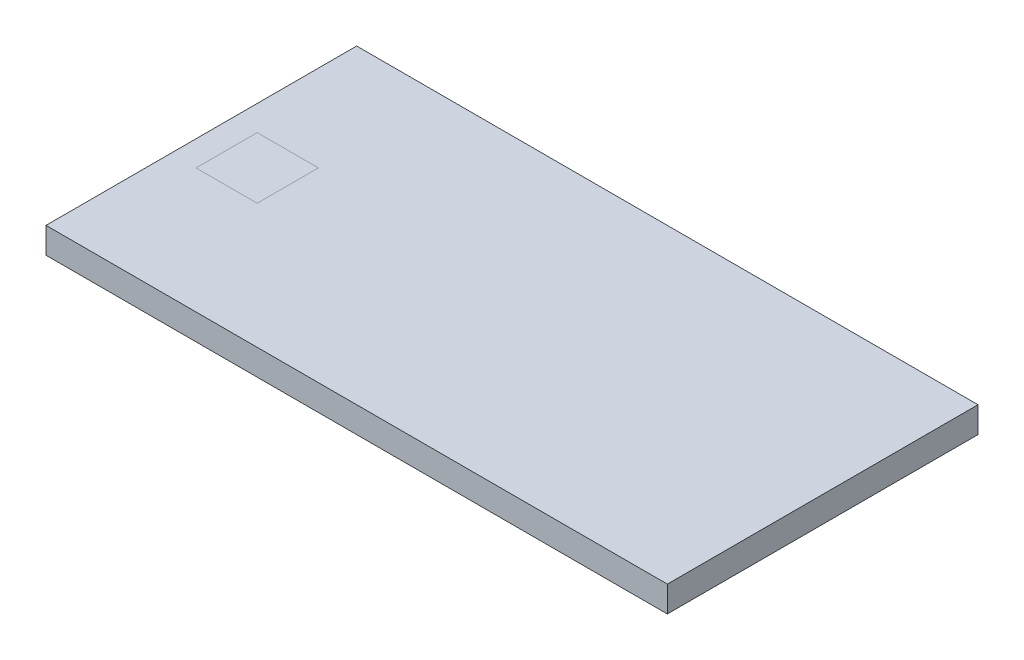
ISO-10303-21;
HEADER;
FILE_DESCRIPTION(('STEP AP214'),'2;1');
FILE_NAME('part.step','',(''),(''),'','','');
FILE_SCHEMA(('AUTOMOTIVE_DESIGN { 1 0 10303 214 1 1 1 1 }'));
ENDSEC;
DATA;
#1=APPLICATION_CONTEXT('core data for automotive mechanical design processes');
#2=APPLICATION_PROTOCOL_DEFINITION('international standard','automotive_design',2000,#1);
#3=PRODUCT_CONTEXT('',#1,'mechanical');
#4=PRODUCT('Part','Part','',(#3));
#5=PRODUCT_RELATED_PRODUCT_CATEGORY('part','',(#4));
#6=PRODUCT_DEFINITION_FORMATION('','',#4);
#7=PRODUCT_DEFINITION_CONTEXT('part definition',#1,'design');
#8=PRODUCT_DEFINITION('design','',#6,#7);
#9=PRODUCT_DEFINITION_SHAPE('','',#8);
#10=(LENGTH_UNIT() NAMED_UNIT(*) SI_UNIT(.MILLI.,.METRE.));
#11=(NAMED_UNIT(*) PLANE_ANGLE_UNIT() SI_UNIT($,.RADIAN.));
#12=(NAMED_UNIT(*) SI_UNIT($,.STERADIAN.) SOLID_ANGLE_UNIT());
#13=UNCERTAINTY_MEASURE_WITH_UNIT(LENGTH_MEASURE(1.E-05),#10,'distance_accuracy_value','');
#14=(GEOMETRIC_REPRESENTATION_CONTEXT(3) GLOBAL_UNCERTAINTY_ASSIGNED_CONTEXT((#13)) GLOBAL_UNIT_ASSIGNED_CONTEXT((#10,
#11,#12)) REPRESENTATION_CONTEXT('',''));
#15=CARTESIAN_POINT('',(0.,0.,0.));
#16=DIRECTION('',(0.,0.,1.));
#17=DIRECTION('',(1.,0.,0.));
#18=AXIS2_PLACEMENT_3D('',#15,#16,#17);
#19=CARTESIAN_POINT('',(914.4,0.,457.2));
#20=DIRECTION('',(0.,-1.,0.));
#21=DIRECTION('',(0.,0.,-1.));
#22=AXIS2_PLACEMENT_3D('',#19,#20,#21);
#23=PLANE('',#22);
#24=DIRECTION('',(-1.,0.,0.));
#25=VECTOR('',#24,1.);
#26=CARTESIAN_POINT('',(914.4,0.,-457.2));
#27=LINE('',#26,#25);
#28=CARTESIAN_POINT('',(914.4,0.,-457.2));
#29=VERTEX_POINT('',#28);
#30=CARTESIAN_POINT('',(-914.4,0.,-457.2));
#31=VERTEX_POINT('',#30);
#32=EDGE_CURVE('E185',#29,#31,#27,.T.);
#33=ORIENTED_EDGE('',*,*,#32,.T.);
#34=DIRECTION('',(0.,0.,1.));
#35=VECTOR('',#34,1.);
#36=CARTESIAN_POINT('',(-914.4,0.,457.2));
#37=LINE('',#36,#35);
#38=CARTESIAN_POINT('',(-914.4,0.,457.2));
#39=VERTEX_POINT('',#38);
#40=EDGE_CURVE('E307',#31,#39,#37,.T.);
#41=ORIENTED_EDGE('',*,*,#40,.T.);
#42=DIRECTION('',(-1.,0.,0.));
#43=VECTOR('',#42,1.);
#44=CARTESIAN_POINT('',(914.4,0.,457.2));
#45=LINE('',#44,#43);
#46=CARTESIAN_POINT('',(914.4,0.,457.2));
#47=VERTEX_POINT('',#46);
#48=EDGE_CURVE('E178',#47,#39,#45,.T.);
#49=ORIENTED_EDGE('',*,*,#48,.F.);
#50=DIRECTION('',(0.,0.,1.));
#51=VECTOR('',#50,1.);
#52=CARTESIAN_POINT('',(914.4,0.,457.2));
#53=LINE('',#52,#51);
#54=EDGE_CURVE('E301',#29,#47,#53,.T.);
#55=ORIENTED_EDGE('',*,*,#54,.F.);
#56=EDGE_LOOP('',(#33,#41,#49,#55));
#57=FACE_BOUND('',#56,.T.);
#58=DIRECTION('',(0.,0.,-1.));
#59=VECTOR('',#58,1.);
#60=CARTESIAN_POINT('',(-660.,0.,457.2));
#61=LINE('',#60,#59);
#62=CARTESIAN_POINT('',(-660.,0.,90.));
#63=VERTEX_POINT('',#62);
#64=CARTESIAN_POINT('',(-660.,0.,-89.9999999999999));
#65=VERTEX_POINT('',#64);
#66=EDGE_CURVE('E12',#63,#65,#61,.T.);
#67=ORIENTED_EDGE('',*,*,#66,.F.);
#68=DIRECTION('',(1.,0.,0.));
#69=VECTOR('',#68,1.);
#70=CARTESIAN_POINT('',(914.4,0.,90.));
#71=LINE('',#70,#69);
#72=CARTESIAN_POINT('',(-840.,0.,90.));
#73=VERTEX_POINT('',#72);
#74=EDGE_CURVE('E202',#73,#63,#71,.T.);
#75=ORIENTED_EDGE('',*,*,#74,.F.);
#76=DIRECTION('',(0.,0.,1.));
#77=VECTOR('',#76,1.);
#78=CARTESIAN_POINT('',(-840.,0.,457.2));
#79=LINE('',#78,#77);
#80=CARTESIAN_POINT('',(-840.,0.,-90.0000000000002));
#81=VERTEX_POINT('',#80);
#82=EDGE_CURVE('E206',#81,#73,#79,.T.);
#83=ORIENTED_EDGE('',*,*,#82,.F.);
#84=DIRECTION('',(-1.,0.,0.));
#85=VECTOR('',#84,1.);
#86=CARTESIAN_POINT('',(914.4,0.,-89.9999999999999));
#87=LINE('',#86,#85);
#88=EDGE_CURVE('E64',#65,#81,#87,.T.);
#89=ORIENTED_EDGE('',*,*,#88,.F.);
#90=EDGE_LOOP('',(#67,#75,#83,#89));
#91=FACE_BOUND('',#90,.T.);
#92=ADVANCED_FACE('F54',(#57,#91),#23,.F.);
#93=CARTESIAN_POINT('',(914.4,-6.35,450.85));
#94=DIRECTION('',(0.,0.,1.));
#95=DIRECTION('',(1.,0.,0.));
#96=AXIS2_PLACEMENT_3D('',#93,#94,#95);
#97=PLANE('',#96);
#98=DIRECTION('',(0.,1.,0.));
#99=VECTOR('',#98,1.);
#100=CARTESIAN_POINT('',(908.05,-6.35,450.85));
#101=LINE('',#100,#99);
#102=CARTESIAN_POINT('',(908.05,-69.85,450.85));
#103=VERTEX_POINT('',#102);
#104=CARTESIAN_POINT('',(908.05,-6.35,450.85));
#105=VERTEX_POINT('',#104);
#106=EDGE_CURVE('E268',#103,#105,#101,.T.);
#107=ORIENTED_EDGE('',*,*,#106,.F.);
#108=DIRECTION('',(-1.,0.,0.));
#109=VECTOR('',#108,1.);
#110=CARTESIAN_POINT('',(914.4,-69.8500000000001,450.85));
#111=LINE('',#110,#109);
#112=CARTESIAN_POINT('',(-908.05,-69.8500000000001,450.85));
#113=VERTEX_POINT('',#112);
#114=EDGE_CURVE('E180',#103,#113,#111,.T.);
#115=ORIENTED_EDGE('',*,*,#114,.T.);
#116=DIRECTION('',(0.,-1.,0.));
#117=VECTOR('',#116,1.);
#118=CARTESIAN_POINT('',(-908.05,-6.35,450.85));
#119=LINE('',#118,#117);
#120=CARTESIAN_POINT('',(-908.05,-6.35,450.85));
#121=VERTEX_POINT('',#120);
#122=EDGE_CURVE('E274',#121,#113,#119,.T.);
#123=ORIENTED_EDGE('',*,*,#122,.F.);
#124=DIRECTION('',(-1.,0.,0.));
#125=VECTOR('',#124,1.);
#126=CARTESIAN_POINT('',(914.4,-6.35,450.85));
#127=LINE('',#126,#125);
#128=EDGE_CURVE('E197',#105,#121,#127,.T.);
#129=ORIENTED_EDGE('',*,*,#128,.F.);
#130=EDGE_LOOP('',(#107,#115,#123,#129));
#131=FACE_BOUND('',#130,.T.);
#132=ADVANCED_FACE('F56',(#131),#97,.F.);
#133=CARTESIAN_POINT('',(914.4,-6.35,450.85));
#134=DIRECTION('',(0.,1.,0.));
#135=DIRECTION('',(0.,0.,1.));
#136=AXIS2_PLACEMENT_3D('',#133,#134,#135);
#137=PLANE('',#136);
#138=DIRECTION('',(0.,0.,-1.));
#139=VECTOR('',#138,1.);
#140=CARTESIAN_POINT('',(908.05,-6.35,450.85));
#141=LINE('',#140,#139);
#142=CARTESIAN_POINT('',(908.05,-6.35,-450.85));
#143=VERTEX_POINT('',#142);
#144=EDGE_CURVE('E261',#105,#143,#141,.T.);
#145=ORIENTED_EDGE('',*,*,#144,.F.);
#146=ORIENTED_EDGE('',*,*,#128,.T.);
#147=DIRECTION('',(0.,0.,1.));
#148=VECTOR('',#147,1.);
#149=CARTESIAN_POINT('',(-908.05,-6.35,450.85));
#150=LINE('',#149,#148);
#151=CARTESIAN_POINT('',(-908.05,-6.35,-450.85));
#152=VERTEX_POINT('',#151);
#153=EDGE_CURVE('E279',#152,#121,#150,.T.);
#154=ORIENTED_EDGE('',*,*,#153,.F.);
#155=DIRECTION('',(-1.,0.,0.));
#156=VECTOR('',#155,1.);
#157=CARTESIAN_POINT('',(914.4,-6.35,-450.85));
#158=LINE('',#157,#156);
#159=EDGE_CURVE('E195',#143,#152,#158,.T.);
#160=ORIENTED_EDGE('',*,*,#159,.F.);
#161=EDGE_LOOP('',(#145,#146,#154,#160));
#162=FACE_BOUND('',#161,.T.);
#163=ADVANCED_FACE('F228',(#162),#137,.F.);
#164=CARTESIAN_POINT('',(914.4,-6.35,-450.85));
#165=DIRECTION('',(0.,0.,-1.));
#166=DIRECTION('',(-1.,0.,0.));
#167=AXIS2_PLACEMENT_3D('',#164,#165,#166);
#168=PLANE('',#167);
#169=DIRECTION('',(0.,-1.,0.));
#170=VECTOR('',#169,1.);
#171=CARTESIAN_POINT('',(908.05,-6.35,-450.85));
#172=LINE('',#171,#170);
#173=CARTESIAN_POINT('',(908.05,-69.85,-450.85));
#174=VERTEX_POINT('',#173);
#175=EDGE_CURVE('E269',#143,#174,#172,.T.);
#176=ORIENTED_EDGE('',*,*,#175,.F.);
#177=ORIENTED_EDGE('',*,*,#159,.T.);
#178=DIRECTION('',(0.,1.,0.));
#179=VECTOR('',#178,1.);
#180=CARTESIAN_POINT('',(-908.05,-6.35,-450.85));
#181=LINE('',#180,#179);
#182=CARTESIAN_POINT('',(-908.05,-69.85,-450.85));
#183=VERTEX_POINT('',#182);
#184=EDGE_CURVE('E284',#183,#152,#181,.T.);
#185=ORIENTED_EDGE('',*,*,#184,.F.);
#186=DIRECTION('',(-1.,0.,0.));
#187=VECTOR('',#186,1.);
#188=CARTESIAN_POINT('',(914.4,-69.85,-450.85));
#189=LINE('',#188,#187);
#190=EDGE_CURVE('E193',#174,#183,#189,.T.);
#191=ORIENTED_EDGE('',*,*,#190,.F.);
#192=EDGE_LOOP('',(#176,#177,#185,#191));
#193=FACE_BOUND('',#192,.T.);
#194=ADVANCED_FACE('F251',(#193),#168,.F.);
#195=CARTESIAN_POINT('',(914.4,-69.85,-381.));
#196=DIRECTION('',(0.,0.,-1.));
#197=DIRECTION('',(-1.,0.,0.));
#198=AXIS2_PLACEMENT_3D('',#195,#196,#197);
#199=PLANE('',#198);
#200=DIRECTION('',(0.,-1.,0.));
#201=VECTOR('',#200,1.);
#202=CARTESIAN_POINT('',(838.2,-69.85,-381.));
#203=LINE('',#202,#201);
#204=CARTESIAN_POINT('',(838.2,-69.85,-381.));
#205=VERTEX_POINT('',#204);
#206=CARTESIAN_POINT('',(838.2,-76.2,-381.));
#207=VERTEX_POINT('',#206);
#208=EDGE_CURVE('E157',#205,#207,#203,.T.);
#209=ORIENTED_EDGE('',*,*,#208,.F.);
#210=DIRECTION('',(-1.,0.,0.));
#211=VECTOR('',#210,1.);
#212=CARTESIAN_POINT('',(914.4,-69.85,-381.));
#213=LINE('',#212,#211);
#214=CARTESIAN_POINT('',(-838.2,-69.85,-381.));
#215=VERTEX_POINT('',#214);
#216=EDGE_CURVE('E191',#205,#215,#213,.T.);
#217=ORIENTED_EDGE('',*,*,#216,.T.);
#218=DIRECTION('',(0.,1.,0.));
#219=VECTOR('',#218,1.);
#220=CARTESIAN_POINT('',(-838.2,-69.85,-381.));
#221=LINE('',#220,#219);
#222=CARTESIAN_POINT('',(-838.2,-76.2,-381.));
#223=VERTEX_POINT('',#222);
#224=EDGE_CURVE('E292',#223,#215,#221,.T.);
#225=ORIENTED_EDGE('',*,*,#224,.F.);
#226=DIRECTION('',(-1.,0.,0.));
#227=VECTOR('',#226,1.);
#228=CARTESIAN_POINT('',(914.4,-76.2,-381.));
#229=LINE('',#228,#227);
#230=EDGE_CURVE('E189',#207,#223,#229,.T.);
#231=ORIENTED_EDGE('',*,*,#230,.F.);
#232=EDGE_LOOP('',(#209,#217,#225,#231));
#233=FACE_BOUND('',#232,.T.);
#234=ADVANCED_FACE('F248',(#233),#199,.F.);
#235=CARTESIAN_POINT('',(914.4,-69.8500000000001,381.));
#236=DIRECTION('',(0.,0.,1.));
#237=DIRECTION('',(1.,0.,0.));
#238=AXIS2_PLACEMENT_3D('',#235,#236,#237);
#239=PLANE('',#238);
#240=DIRECTION('',(0.,1.,0.));
#241=VECTOR('',#240,1.);
#242=CARTESIAN_POINT('',(838.2,-69.8500000000001,381.));
#243=LINE('',#242,#241);
#244=CARTESIAN_POINT('',(838.2,-76.2,381.));
#245=VERTEX_POINT('',#244);
#246=CARTESIAN_POINT('',(838.2,-69.85,381.));
#247=VERTEX_POINT('',#246);
#248=EDGE_CURVE('E154',#245,#247,#243,.T.);
#249=ORIENTED_EDGE('',*,*,#248,.F.);
#250=DIRECTION('',(-1.,0.,0.));
#251=VECTOR('',#250,1.);
#252=CARTESIAN_POINT('',(914.4,-76.2,381.));
#253=LINE('',#252,#251);
#254=CARTESIAN_POINT('',(-838.2,-76.2,381.));
#255=VERTEX_POINT('',#254);
#256=EDGE_CURVE('E167',#245,#255,#253,.T.);
#257=ORIENTED_EDGE('',*,*,#256,.T.);
#258=DIRECTION('',(0.,-1.,0.));
#259=VECTOR('',#258,1.);
#260=CARTESIAN_POINT('',(-838.2,-69.8500000000001,381.));
#261=LINE('',#260,#259);
#262=CARTESIAN_POINT('',(-838.2,-69.8500000000001,381.));
#263=VERTEX_POINT('',#262);
#264=EDGE_CURVE('E278',#263,#255,#261,.T.);
#265=ORIENTED_EDGE('',*,*,#264,.F.);
#266=DIRECTION('',(-1.,0.,0.));
#267=VECTOR('',#266,1.);
#268=CARTESIAN_POINT('',(914.4,-69.8500000000001,381.));
#269=LINE('',#268,#267);
#270=EDGE_CURVE('E169',#247,#263,#269,.T.);
#271=ORIENTED_EDGE('',*,*,#270,.F.);
#272=EDGE_LOOP('',(#249,#257,#265,#271));
#273=FACE_BOUND('',#272,.T.);
#274=ADVANCED_FACE('F165',(#273),#239,.F.);
#275=CARTESIAN_POINT('',(914.4,-69.8500000000001,450.85));
#276=DIRECTION('',(0.,-1.,0.));
#277=DIRECTION('',(0.,0.,-1.));
#278=AXIS2_PLACEMENT_3D('',#275,#276,#277);
#279=PLANE('',#278);
#280=ORIENTED_EDGE('',*,*,#216,.F.);
#281=DIRECTION('',(0.,0.,-1.));
#282=VECTOR('',#281,1.);
#283=CARTESIAN_POINT('',(838.2,-69.85,457.2));
#284=LINE('',#283,#282);
#285=EDGE_CURVE('E161',#247,#205,#284,.T.);
#286=ORIENTED_EDGE('',*,*,#285,.F.);
#287=ORIENTED_EDGE('',*,*,#270,.T.);
#288=DIRECTION('',(0.,0.,-1.));
#289=VECTOR('',#288,1.);
#290=CARTESIAN_POINT('',(-838.2,-69.85,457.2));
#291=LINE('',#290,#289);
#292=EDGE_CURVE('E480',#263,#215,#291,.T.);
#293=ORIENTED_EDGE('',*,*,#292,.T.);
#294=EDGE_LOOP('',(#280,#286,#287,#293));
#295=FACE_BOUND('',#294,.T.);
#296=DIRECTION('',(0.,0.,-1.));
#297=VECTOR('',#296,1.);
#298=CARTESIAN_POINT('',(908.05,-69.85,457.2));
#299=LINE('',#298,#297);
#300=EDGE_CURVE('E471',#103,#174,#299,.T.);
#301=ORIENTED_EDGE('',*,*,#300,.T.);
#302=ORIENTED_EDGE('',*,*,#190,.T.);
#303=DIRECTION('',(0.,0.,-1.));
#304=VECTOR('',#303,1.);
#305=CARTESIAN_POINT('',(-908.05,-69.8500000000001,450.85));
#306=LINE('',#305,#304);
#307=EDGE_CURVE('E199',#113,#183,#306,.T.);
#308=ORIENTED_EDGE('',*,*,#307,.F.);
#309=ORIENTED_EDGE('',*,*,#114,.F.);
#310=EDGE_LOOP('',(#301,#302,#308,#309));
#311=FACE_BOUND('',#310,.T.);
#312=ADVANCED_FACE('F239',(#295,#311),#279,.F.);
#313=CARTESIAN_POINT('',(914.4,0.,-457.2));
#314=DIRECTION('',(0.,0.,1.));
#315=DIRECTION('',(0.,-1.,0.));
#316=AXIS2_PLACEMENT_3D('',#313,#314,#315);
#317=PLANE('',#316);
#318=DIRECTION('',(0.,1.,0.));
#319=VECTOR('',#318,1.);
#320=CARTESIAN_POINT('',(-914.4,0.,-457.2));
#321=LINE('',#320,#319);
#322=CARTESIAN_POINT('',(-914.4,-76.2,-457.2));
#323=VERTEX_POINT('',#322);
#324=EDGE_CURVE('E295',#323,#31,#321,.T.);
#325=ORIENTED_EDGE('',*,*,#324,.T.);
#326=ORIENTED_EDGE('',*,*,#32,.F.);
#327=DIRECTION('',(0.,1.,0.));
#328=VECTOR('',#327,1.);
#329=CARTESIAN_POINT('',(914.4,0.,-457.2));
#330=LINE('',#329,#328);
#331=CARTESIAN_POINT('',(914.4,-76.2,-457.2));
#332=VERTEX_POINT('',#331);
#333=EDGE_CURVE('E298',#332,#29,#330,.T.);
#334=ORIENTED_EDGE('',*,*,#333,.F.);
#335=DIRECTION('',(-1.,0.,0.));
#336=VECTOR('',#335,1.);
#337=CARTESIAN_POINT('',(914.4,-76.2,-457.2));
#338=LINE('',#337,#336);
#339=EDGE_CURVE('E187',#332,#323,#338,.T.);
#340=ORIENTED_EDGE('',*,*,#339,.T.);
#341=EDGE_LOOP('',(#325,#326,#334,#340));
#342=FACE_BOUND('',#341,.T.);
#343=ADVANCED_FACE('F234',(#342),#317,.F.);
#344=ORIENTED_EDGE('',*,*,#74,.T.);
#345=ORIENTED_EDGE('',*,*,#66,.T.);
#346=ORIENTED_EDGE('',*,*,#88,.T.);
#347=ORIENTED_EDGE('',*,*,#82,.T.);
#348=EDGE_LOOP('',(#344,#345,#346,#347));
#349=FACE_BOUND('',#348,.T.);
#350=ADVANCED_FACE('F218',(#349),#23,.F.);
#351=CARTESIAN_POINT('',(914.4,0.,457.2));
#352=DIRECTION('',(0.,0.,-1.));
#353=DIRECTION('',(0.,1.,0.));
#354=AXIS2_PLACEMENT_3D('',#351,#352,#353);
#355=PLANE('',#354);
#356=ORIENTED_EDGE('',*,*,#48,.T.);
#357=DIRECTION('',(0.,-1.,0.));
#358=VECTOR('',#357,1.);
#359=CARTESIAN_POINT('',(-914.4,0.,457.2));
#360=LINE('',#359,#358);
#361=CARTESIAN_POINT('',(-914.4,-76.2,457.2));
#362=VERTEX_POINT('',#361);
#363=EDGE_CURVE('E311',#39,#362,#360,.T.);
#364=ORIENTED_EDGE('',*,*,#363,.T.);
#365=DIRECTION('',(-1.,0.,0.));
#366=VECTOR('',#365,1.);
#367=CARTESIAN_POINT('',(914.4,-76.2,457.2));
#368=LINE('',#367,#366);
#369=CARTESIAN_POINT('',(914.4,-76.2,457.2));
#370=VERTEX_POINT('',#369);
#371=EDGE_CURVE('E176',#370,#362,#368,.T.);
#372=ORIENTED_EDGE('',*,*,#371,.F.);
#373=DIRECTION('',(0.,-1.,0.));
#374=VECTOR('',#373,1.);
#375=CARTESIAN_POINT('',(914.4,0.,457.2));
#376=LINE('',#375,#374);
#377=EDGE_CURVE('E303',#47,#370,#376,.T.);
#378=ORIENTED_EDGE('',*,*,#377,.F.);
#379=EDGE_LOOP('',(#356,#364,#372,#378));
#380=FACE_BOUND('',#379,.T.);
#381=ADVANCED_FACE('F233',(#380),#355,.F.);
#382=CARTESIAN_POINT('',(914.4,-76.2,457.2));
#383=DIRECTION('',(0.,1.,0.));
#384=DIRECTION('',(0.,0.,1.));
#385=AXIS2_PLACEMENT_3D('',#382,#383,#384);
#386=PLANE('',#385);
#387=DIRECTION('',(0.,0.,-1.));
#388=VECTOR('',#387,1.);
#389=CARTESIAN_POINT('',(838.2,-76.2,457.2));
#390=LINE('',#389,#388);
#391=EDGE_CURVE('E151',#245,#207,#390,.T.);
#392=ORIENTED_EDGE('',*,*,#391,.T.);
#393=ORIENTED_EDGE('',*,*,#230,.T.);
#394=DIRECTION('',(0.,0.,-1.));
#395=VECTOR('',#394,1.);
#396=CARTESIAN_POINT('',(-838.2,-76.2,457.2));
#397=LINE('',#396,#395);
#398=EDGE_CURVE('E175',#255,#223,#397,.T.);
#399=ORIENTED_EDGE('',*,*,#398,.F.);
#400=ORIENTED_EDGE('',*,*,#256,.F.);
#401=EDGE_LOOP('',(#392,#393,#399,#400));
#402=FACE_BOUND('',#401,.T.);
#403=DIRECTION('',(0.,0.,-1.));
#404=VECTOR('',#403,1.);
#405=CARTESIAN_POINT('',(914.4,-76.2,-457.2));
#406=LINE('',#405,#404);
#407=EDGE_CURVE('E296',#370,#332,#406,.T.);
#408=ORIENTED_EDGE('',*,*,#407,.F.);
#409=ORIENTED_EDGE('',*,*,#371,.T.);
#410=DIRECTION('',(0.,0.,-1.));
#411=VECTOR('',#410,1.);
#412=CARTESIAN_POINT('',(-914.4,-76.2,457.2));
#413=LINE('',#412,#411);
#414=EDGE_CURVE('E299',#362,#323,#413,.T.);
#415=ORIENTED_EDGE('',*,*,#414,.T.);
#416=ORIENTED_EDGE('',*,*,#339,.F.);
#417=EDGE_LOOP('',(#408,#409,#415,#416));
#418=FACE_BOUND('',#417,.T.);
#419=ADVANCED_FACE('F172',(#402,#418),#386,.F.);
#420=CARTESIAN_POINT('',(914.4,0.,0.));
#421=DIRECTION('',(1.,0.,0.));
#422=DIRECTION('',(0.,0.,-1.));
#423=AXIS2_PLACEMENT_3D('',#420,#421,#422);
#424=PLANE('',#423);
#425=ORIENTED_EDGE('',*,*,#377,.T.);
#426=ORIENTED_EDGE('',*,*,#407,.T.);
#427=ORIENTED_EDGE('',*,*,#333,.T.);
#428=ORIENTED_EDGE('',*,*,#54,.T.);
#429=EDGE_LOOP('',(#425,#426,#427,#428));
#430=FACE_BOUND('',#429,.T.);
#431=ADVANCED_FACE('F327',(#430),#424,.T.);
#432=CARTESIAN_POINT('',(-914.4,0.,0.));
#433=DIRECTION('',(1.,0.,0.));
#434=DIRECTION('',(0.,0.,-1.));
#435=AXIS2_PLACEMENT_3D('',#432,#433,#434);
#436=PLANE('',#435);
#437=ORIENTED_EDGE('',*,*,#324,.F.);
#438=ORIENTED_EDGE('',*,*,#414,.F.);
#439=ORIENTED_EDGE('',*,*,#363,.F.);
#440=ORIENTED_EDGE('',*,*,#40,.F.);
#441=EDGE_LOOP('',(#437,#438,#439,#440));
#442=FACE_BOUND('',#441,.T.);
#443=ADVANCED_FACE('F323',(#442),#436,.F.);
#444=CARTESIAN_POINT('',(-838.2,-76.2,457.2));
#445=DIRECTION('',(-1.,0.,0.));
#446=DIRECTION('',(0.,0.,1.));
#447=AXIS2_PLACEMENT_3D('',#444,#445,#446);
#448=PLANE('',#447);
#449=ORIENTED_EDGE('',*,*,#398,.T.);
#450=ORIENTED_EDGE('',*,*,#224,.T.);
#451=ORIENTED_EDGE('',*,*,#292,.F.);
#452=ORIENTED_EDGE('',*,*,#264,.T.);
#453=EDGE_LOOP('',(#449,#450,#451,#452));
#454=FACE_BOUND('',#453,.T.);
#455=ADVANCED_FACE('F336',(#454),#448,.F.);
#456=CARTESIAN_POINT('',(-908.05,-69.85,457.2));
#457=DIRECTION('',(-1.,0.,0.));
#458=DIRECTION('',(0.,0.,1.));
#459=AXIS2_PLACEMENT_3D('',#456,#457,#458);
#460=PLANE('',#459);
#461=ORIENTED_EDGE('',*,*,#153,.T.);
#462=ORIENTED_EDGE('',*,*,#122,.T.);
#463=ORIENTED_EDGE('',*,*,#307,.T.);
#464=ORIENTED_EDGE('',*,*,#184,.T.);
#465=EDGE_LOOP('',(#461,#462,#463,#464));
#466=FACE_BOUND('',#465,.T.);
#467=ADVANCED_FACE('F282',(#466),#460,.F.);
#468=CARTESIAN_POINT('',(908.05,-69.85,457.2));
#469=DIRECTION('',(1.,0.,0.));
#470=DIRECTION('',(0.,0.,-1.));
#471=AXIS2_PLACEMENT_3D('',#468,#469,#470);
#472=PLANE('',#471);
#473=ORIENTED_EDGE('',*,*,#300,.F.);
#474=ORIENTED_EDGE('',*,*,#106,.T.);
#475=ORIENTED_EDGE('',*,*,#144,.T.);
#476=ORIENTED_EDGE('',*,*,#175,.T.);
#477=EDGE_LOOP('',(#473,#474,#475,#476));
#478=FACE_BOUND('',#477,.T.);
#479=ADVANCED_FACE('F400',(#478),#472,.F.);
#480=CARTESIAN_POINT('',(838.2,-76.2,457.2));
#481=DIRECTION('',(1.,0.,0.));
#482=DIRECTION('',(0.,0.,-1.));
#483=AXIS2_PLACEMENT_3D('',#480,#481,#482);
#484=PLANE('',#483);
#485=ORIENTED_EDGE('',*,*,#285,.T.);
#486=ORIENTED_EDGE('',*,*,#208,.T.);
#487=ORIENTED_EDGE('',*,*,#391,.F.);
#488=ORIENTED_EDGE('',*,*,#248,.T.);
#489=EDGE_LOOP('',(#485,#486,#487,#488));
#490=FACE_BOUND('',#489,.T.);
#491=ADVANCED_FACE('F153',(#490),#484,.F.);
#492=CLOSED_SHELL('',(#92,#132,#163,#194,#234,#274,#312,#343,#350,#381,#419,#431,#443,#455,#467,
#479,#491));
#493=MANIFOLD_SOLID_BREP('B2',#492);
#494=ADVANCED_BREP_SHAPE_REPRESENTATION('',(#18,#493),#14);
#495=SHAPE_DEFINITION_REPRESENTATION(#9,#494);
ENDSEC;
END-ISO-10303-21;
